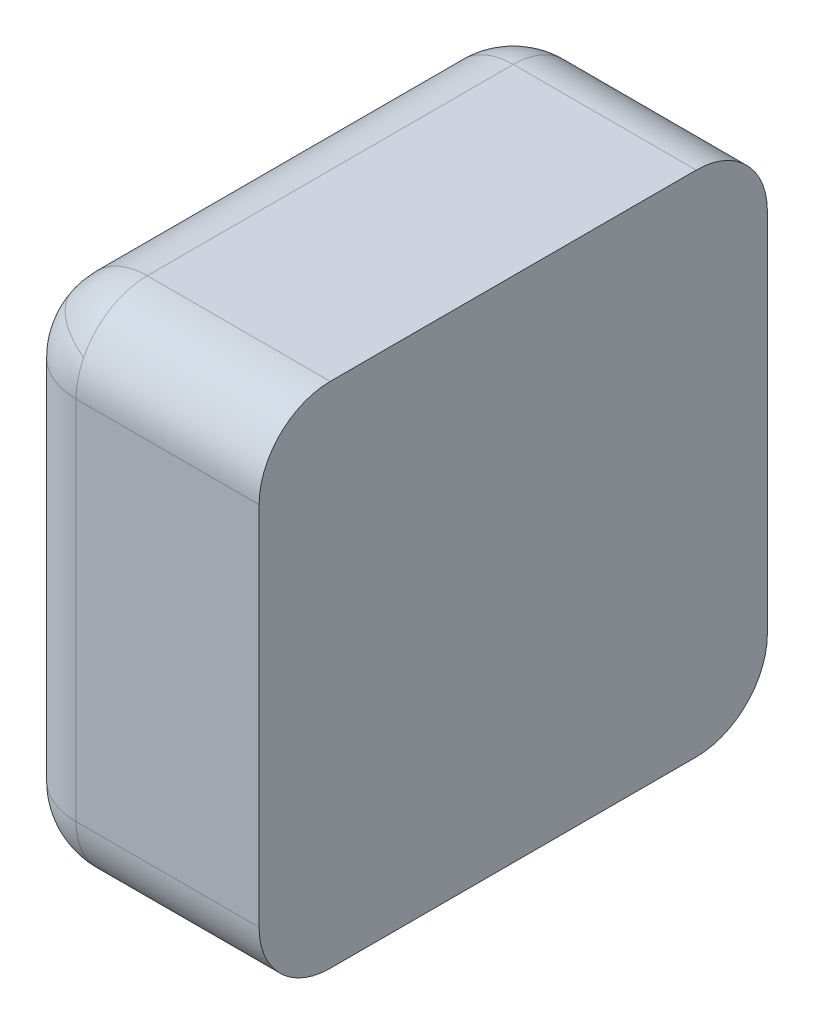
ISO-10303-21;
HEADER;
FILE_DESCRIPTION(('STEP AP214'),'2;1');
FILE_NAME('part.step','',(''),(''),'','','');
FILE_SCHEMA(('AUTOMOTIVE_DESIGN { 1 0 10303 214 1 1 1 1 }'));
ENDSEC;
DATA;
#1=APPLICATION_CONTEXT('core data for automotive mechanical design processes');
#2=APPLICATION_PROTOCOL_DEFINITION('international standard','automotive_design',2000,#1);
#3=PRODUCT_CONTEXT('',#1,'mechanical');
#4=PRODUCT('Part','Part','',(#3));
#5=PRODUCT_RELATED_PRODUCT_CATEGORY('part','',(#4));
#6=PRODUCT_DEFINITION_FORMATION('','',#4);
#7=PRODUCT_DEFINITION_CONTEXT('part definition',#1,'design');
#8=PRODUCT_DEFINITION('design','',#6,#7);
#9=PRODUCT_DEFINITION_SHAPE('','',#8);
#10=(LENGTH_UNIT() NAMED_UNIT(*) SI_UNIT(.MILLI.,.METRE.));
#11=(NAMED_UNIT(*) PLANE_ANGLE_UNIT() SI_UNIT($,.RADIAN.));
#12=(NAMED_UNIT(*) SI_UNIT($,.STERADIAN.) SOLID_ANGLE_UNIT());
#13=UNCERTAINTY_MEASURE_WITH_UNIT(LENGTH_MEASURE(1.E-05),#10,'distance_accuracy_value','');
#14=(GEOMETRIC_REPRESENTATION_CONTEXT(3) GLOBAL_UNCERTAINTY_ASSIGNED_CONTEXT((#13)) GLOBAL_UNIT_ASSIGNED_CONTEXT((#10,
#11,#12)) REPRESENTATION_CONTEXT('',''));
#15=CARTESIAN_POINT('',(0.,0.,0.));
#16=DIRECTION('',(0.,0.,1.));
#17=DIRECTION('',(1.,0.,0.));
#18=AXIS2_PLACEMENT_3D('',#15,#16,#17);
#19=CARTESIAN_POINT('',(-0.470414518843274,-0.220414518843274,0.0295854811567262));
#20=CARTESIAN_POINT('',(-0.470414518843274,-0.220414518843274,0.0295854811567261));
#21=CARTESIAN_POINT('',(-0.470414518843274,-0.220414518843274,0.0295854811567261));
#22=CARTESIAN_POINT('',(-0.470414518843274,-0.220414518843274,0.0295854811567261));
#23=CARTESIAN_POINT('',(-0.470414518843274,-0.203915602470369,0.0130865647838216));
#24=CARTESIAN_POINT('',(-0.432311903606339,-0.222966910088836,-0.00596474283464581));
#25=CARTESIAN_POINT('',(-0.432311903606339,-0.255964742834646,0.0270330899111634));
#26=CARTESIAN_POINT('',(-0.470414518843274,-0.236913435216178,0.0460843975296308));
#27=CARTESIAN_POINT('',(-0.464187485463227,-0.183058110300326,0.00468313937387294));
#28=CARTESIAN_POINT('',(-0.392297272943205,-0.219003216560337,-0.0312619668861382));
#29=CARTESIAN_POINT('',(-0.392297272943205,-0.281261966886138,0.0309967834396629));
#30=CARTESIAN_POINT('',(-0.464187485463227,-0.245316860626127,0.0669418896996739));
#31=CARTESIAN_POINT('',(-0.453143808025074,-0.16256615130185,0.00627853525170238));
#32=CARTESIAN_POINT('',(-0.359433723896123,-0.209421193366325,-0.0405765068127731));
#33=CARTESIAN_POINT('',(-0.359433723896123,-0.290576506812773,0.0405788066336749));
#34=CARTESIAN_POINT('',(-0.453143808025074,-0.243721464748298,0.0874338486981503));
#35=(BOUNDED_SURFACE() B_SPLINE_SURFACE(3,3,((#19,#20,#21,#22),(#23,#24,#25,#26),(#27,#28,#29,
#30),(#31,#32,#33,#34)),.UNSPECIFIED.,.F.,.F.,.F.) B_SPLINE_SURFACE_WITH_KNOTS((4,4),(4,4),(0.,
1.),(0.,1.),.UNSPECIFIED.) GEOMETRIC_REPRESENTATION_ITEM() RATIONAL_B_SPLINE_SURFACE(((1.,
0.333333333333333,0.333333333333333,1.),(0.924501806030638,0.308167268676879,0.308167268676879,
0.924501806030638),(0.924501806030638,0.308167268676879,0.308167268676879,0.924501806030638),
(1.,0.333333333333333,0.333333333333333,1.))) REPRESENTATION_ITEM('') SURFACE());
#36=CARTESIAN_POINT('',(-0.43,-0.18,0.07));
#37=DIRECTION('',(-0.816496580927726,0.408248290463863,0.408248290463863));
#38=DIRECTION('',(-0.577350269189626,-0.577350269189626,-0.577350269189626));
#39=AXIS2_PLACEMENT_3D('',#36,#37,#38);
#40=CIRCLE('',#39,0.07);
#41=CARTESIAN_POINT('',(-0.470414518843274,-0.220414518843274,0.0295854811567262));
#42=VERTEX_POINT('',#41);
#43=CARTESIAN_POINT('',(-0.461304951684997,-0.242609903369994,0.07));
#44=VERTEX_POINT('',#43);
#45=EDGE_CURVE('E11',#42,#44,#40,.T.);
#46=CARTESIAN_POINT('',(-0.43,-0.18,0.07));
#47=DIRECTION('',(0.816496580927726,-0.408248290463863,-0.408248290463863));
#48=DIRECTION('',(-0.577350269189626,-0.577350269189626,-0.577350269189626));
#49=AXIS2_PLACEMENT_3D('',#46,#47,#48);
#50=CIRCLE('',#49,0.07);
#51=CARTESIAN_POINT('',(-0.461304951684997,-0.18,0.00739009663000594));
#52=VERTEX_POINT('',#51);
#53=EDGE_CURVE('E26',#42,#52,#50,.T.);
#54=CARTESIAN_POINT('',(-0.43,-0.18,0.07));
#55=DIRECTION('',(0.,1.,0.));
#56=DIRECTION('',(1.,0.,0.));
#57=AXIS2_PLACEMENT_3D('',#54,#55,#56);
#58=CIRCLE('',#57,0.07);
#59=CARTESIAN_POINT('',(-0.43,-0.18,0.));
#60=VERTEX_POINT('',#59);
#61=EDGE_CURVE('E273',#60,#52,#58,.T.);
#62=CARTESIAN_POINT('',(-0.43,-0.18,0.07));
#63=DIRECTION('',(1.,0.,0.));
#64=DIRECTION('',(0.,0.,-1.));
#65=AXIS2_PLACEMENT_3D('',#62,#63,#64);
#66=CIRCLE('',#65,0.07);
#67=CARTESIAN_POINT('',(-0.43,-0.25,0.07));
#68=VERTEX_POINT('',#67);
#69=EDGE_CURVE('E270',#68,#60,#66,.T.);
#70=CARTESIAN_POINT('',(-0.43,-0.18,0.07));
#71=DIRECTION('',(0.,0.,-1.));
#72=DIRECTION('',(1.,0.,0.));
#73=AXIS2_PLACEMENT_3D('',#70,#71,#72);
#74=CIRCLE('',#73,0.07);
#75=EDGE_CURVE('E268',#68,#44,#74,.T.);
#76=ORIENTED_EDGE('',*,*,#45,.F.);
#77=ORIENTED_EDGE('',*,*,#53,.T.);
#78=ORIENTED_EDGE('',*,*,#61,.F.);
#79=ORIENTED_EDGE('',*,*,#69,.F.);
#80=ORIENTED_EDGE('',*,*,#75,.T.);
#81=EDGE_LOOP('',(#76,#77,#78,#79,#80));
#82=FACE_BOUND('',#81,.T.);
#83=ADVANCED_FACE('F17',(#82),#35,.T.);
#84=CARTESIAN_POINT('',(-0.470414518843274,-0.220414518843274,0.470414518843274));
#85=CARTESIAN_POINT('',(-0.470414518843274,-0.220414518843274,0.470414518843274));
#86=CARTESIAN_POINT('',(-0.470414518843274,-0.220414518843274,0.470414518843274));
#87=CARTESIAN_POINT('',(-0.470414518843274,-0.220414518843274,0.470414518843274));
#88=CARTESIAN_POINT('',(-0.453915602470369,-0.236913435216179,0.470414518843274));
#89=CARTESIAN_POINT('',(-0.434864294851902,-0.217862127597711,0.508517134080208));
#90=CARTESIAN_POINT('',(-0.467862127597711,-0.184864294851902,0.508517134080209));
#91=CARTESIAN_POINT('',(-0.486913435216178,-0.203915602470369,0.470414518843274));
#92=CARTESIAN_POINT('',(-0.433058110300326,-0.245316860626127,0.464187485463227));
#93=CARTESIAN_POINT('',(-0.397113004040315,-0.209371754366116,0.536077697983249));
#94=CARTESIAN_POINT('',(-0.459371754366116,-0.147113004040315,0.536077697983248));
#95=CARTESIAN_POINT('',(-0.495316860626127,-0.183058110300326,0.464187485463227));
#96=CARTESIAN_POINT('',(-0.41256615130185,-0.243721464748298,0.453143808025074));
#97=CARTESIAN_POINT('',(-0.365711109237374,-0.196866422683823,0.546853892154024));
#98=CARTESIAN_POINT('',(-0.446866422683823,-0.115711109237374,0.546853892154024));
#99=CARTESIAN_POINT('',(-0.493721464748298,-0.16256615130185,0.453143808025074));
#100=(BOUNDED_SURFACE() B_SPLINE_SURFACE(3,3,((#84,#85,#86,#87),(#88,#89,#90,#91),(#92,#93,#94,
#95),(#96,#97,#98,#99)),.UNSPECIFIED.,.F.,.F.,.F.) B_SPLINE_SURFACE_WITH_KNOTS((4,4),(4,4),(0.,
1.),(0.,1.),.UNSPECIFIED.) GEOMETRIC_REPRESENTATION_ITEM() RATIONAL_B_SPLINE_SURFACE(((1.,
0.333333333333333,0.333333333333333,1.),(0.924501806030637,0.308167268676879,0.308167268676879,
0.924501806030637),(0.924501806030637,0.308167268676879,0.308167268676879,0.924501806030637),
(1.,0.333333333333333,0.333333333333333,1.))) REPRESENTATION_ITEM('') SURFACE());
#101=CARTESIAN_POINT('',(-0.43,-0.18,0.43));
#102=DIRECTION('',(-0.408248290463863,-0.408248290463863,-0.816496580927726));
#103=DIRECTION('',(-0.577350269189626,-0.577350269189626,0.577350269189626));
#104=AXIS2_PLACEMENT_3D('',#101,#102,#103);
#105=CIRCLE('',#104,0.07);
#106=CARTESIAN_POINT('',(-0.470414518843274,-0.220414518843274,0.470414518843274));
#107=VERTEX_POINT('',#106);
#108=CARTESIAN_POINT('',(-0.492609903369994,-0.18,0.461304951684997));
#109=VERTEX_POINT('',#108);
#110=EDGE_CURVE('E266',#107,#109,#105,.T.);
#111=CARTESIAN_POINT('',(-0.43,-0.18,0.43));
#112=DIRECTION('',(0.408248290463863,0.408248290463863,0.816496580927726));
#113=DIRECTION('',(-0.577350269189626,-0.577350269189626,0.577350269189626));
#114=AXIS2_PLACEMENT_3D('',#111,#112,#113);
#115=CIRCLE('',#114,0.07);
#116=CARTESIAN_POINT('',(-0.43,-0.242609903369994,0.461304951684997));
#117=VERTEX_POINT('',#116);
#118=EDGE_CURVE('E264',#107,#117,#115,.T.);
#119=CARTESIAN_POINT('',(-0.43,-0.18,0.43));
#120=DIRECTION('',(1.,0.,0.));
#121=DIRECTION('',(0.,0.,-1.));
#122=AXIS2_PLACEMENT_3D('',#119,#120,#121);
#123=CIRCLE('',#122,0.07);
#124=CARTESIAN_POINT('',(-0.43,-0.18,0.5));
#125=VERTEX_POINT('',#124);
#126=EDGE_CURVE('E261',#125,#117,#123,.T.);
#127=CARTESIAN_POINT('',(-0.43,-0.18,0.43));
#128=DIRECTION('',(0.,-1.,0.));
#129=DIRECTION('',(1.,0.,0.));
#130=AXIS2_PLACEMENT_3D('',#127,#128,#129);
#131=CIRCLE('',#130,0.07);
#132=EDGE_CURVE('E258',#125,#109,#131,.T.);
#133=ORIENTED_EDGE('',*,*,#110,.F.);
#134=ORIENTED_EDGE('',*,*,#118,.T.);
#135=ORIENTED_EDGE('',*,*,#126,.F.);
#136=ORIENTED_EDGE('',*,*,#132,.T.);
#137=EDGE_LOOP('',(#133,#134,#135,#136));
#138=FACE_BOUND('',#137,.T.);
#139=ADVANCED_FACE('F333',(#138),#100,.T.);
#140=CARTESIAN_POINT('',(-0.470414518843274,0.220414518843274,0.470414518843274));
#141=CARTESIAN_POINT('',(-0.470414518843274,0.220414518843274,0.470414518843274));
#142=CARTESIAN_POINT('',(-0.470414518843274,0.220414518843274,0.470414518843274));
#143=CARTESIAN_POINT('',(-0.470414518843274,0.220414518843274,0.470414518843274));
#144=CARTESIAN_POINT('',(-0.453915602470369,0.220414518843274,0.486913435216178));
#145=CARTESIAN_POINT('',(-0.434864294851902,0.258517134080208,0.467862127597711));
#146=CARTESIAN_POINT('',(-0.467862127597712,0.258517134080208,0.434864294851902));
#147=CARTESIAN_POINT('',(-0.486913435216179,0.220414518843274,0.453915602470369));
#148=CARTESIAN_POINT('',(-0.433058110300326,0.214187485463227,0.495316860626127));
#149=CARTESIAN_POINT('',(-0.397113004040315,0.286077697983249,0.459371754366116));
#150=CARTESIAN_POINT('',(-0.459371754366116,0.286077697983249,0.397113004040315));
#151=CARTESIAN_POINT('',(-0.495316860626127,0.214187485463227,0.433058110300326));
#152=CARTESIAN_POINT('',(-0.41256615130185,0.203143808025074,0.493721464748298));
#153=CARTESIAN_POINT('',(-0.365711109237374,0.296853892154024,0.446866422683822));
#154=CARTESIAN_POINT('',(-0.446866422683822,0.296853892154024,0.365711109237375));
#155=CARTESIAN_POINT('',(-0.493721464748298,0.203143808025074,0.41256615130185));
#156=(BOUNDED_SURFACE() B_SPLINE_SURFACE(3,3,((#140,#141,#142,#143),(#144,#145,#146,#147),(#148,
#149,#150,#151),(#152,#153,#154,#155)),.UNSPECIFIED.,.F.,.F.,
.F.) B_SPLINE_SURFACE_WITH_KNOTS((4,4),(4,4),(0.,1.),(0.,1.),
.UNSPECIFIED.) GEOMETRIC_REPRESENTATION_ITEM() RATIONAL_B_SPLINE_SURFACE(((1.,0.333333333333333,
0.333333333333333,1.),(0.924501806030637,0.308167268676879,0.308167268676879,0.924501806030637),
(0.924501806030637,0.308167268676879,0.308167268676879,0.924501806030637),(1.,0.333333333333333,
0.333333333333333,1.))) REPRESENTATION_ITEM('') SURFACE());
#157=CARTESIAN_POINT('',(-0.43,0.18,0.43));
#158=DIRECTION('',(-0.408248290463863,-0.816496580927726,0.408248290463863));
#159=DIRECTION('',(-0.577350269189626,0.577350269189626,0.577350269189626));
#160=AXIS2_PLACEMENT_3D('',#157,#158,#159);
#161=CIRCLE('',#160,0.07);
#162=CARTESIAN_POINT('',(-0.470414518843274,0.220414518843274,0.470414518843274));
#163=VERTEX_POINT('',#162);
#164=CARTESIAN_POINT('',(-0.492609903369994,0.211304951684997,0.43));
#165=VERTEX_POINT('',#164);
#166=EDGE_CURVE('E157',#163,#165,#161,.T.);
#167=CARTESIAN_POINT('',(-0.43,0.18,0.43));
#168=DIRECTION('',(0.408248290463863,0.816496580927726,-0.408248290463863));
#169=DIRECTION('',(-0.577350269189626,0.577350269189626,0.577350269189626));
#170=AXIS2_PLACEMENT_3D('',#167,#168,#169);
#171=CIRCLE('',#170,0.07);
#172=CARTESIAN_POINT('',(-0.43,0.211304951684997,0.492609903369994));
#173=VERTEX_POINT('',#172);
#174=EDGE_CURVE('E255',#163,#173,#171,.T.);
#175=CARTESIAN_POINT('',(-0.43,0.18,0.43));
#176=DIRECTION('',(1.,0.,0.));
#177=DIRECTION('',(0.,-1.,0.));
#178=AXIS2_PLACEMENT_3D('',#175,#176,#177);
#179=CIRCLE('',#178,0.07);
#180=CARTESIAN_POINT('',(-0.43,0.25,0.43));
#181=VERTEX_POINT('',#180);
#182=EDGE_CURVE('E252',#181,#173,#179,.T.);
#183=CARTESIAN_POINT('',(-0.43,0.18,0.43));
#184=DIRECTION('',(0.,0.,1.));
#185=DIRECTION('',(1.,0.,0.));
#186=AXIS2_PLACEMENT_3D('',#183,#184,#185);
#187=CIRCLE('',#186,0.07);
#188=EDGE_CURVE('E250',#181,#165,#187,.T.);
#189=ORIENTED_EDGE('',*,*,#166,.F.);
#190=ORIENTED_EDGE('',*,*,#174,.T.);
#191=ORIENTED_EDGE('',*,*,#182,.F.);
#192=ORIENTED_EDGE('',*,*,#188,.T.);
#193=EDGE_LOOP('',(#189,#190,#191,#192));
#194=FACE_BOUND('',#193,.T.);
#195=ADVANCED_FACE('F304',(#194),#156,.T.);
#196=CARTESIAN_POINT('',(-0.470414518843274,0.220414518843274,0.0295854811567263));
#197=CARTESIAN_POINT('',(-0.470414518843274,0.220414518843274,0.0295854811567262));
#198=CARTESIAN_POINT('',(-0.470414518843274,0.220414518843274,0.029585481156726));
#199=CARTESIAN_POINT('',(-0.470414518843274,0.220414518843274,0.0295854811567261));
#200=CARTESIAN_POINT('',(-0.486913435216178,0.220414518843274,0.0460843975296309));
#201=CARTESIAN_POINT('',(-0.467862127597711,0.258517134080208,0.065135705148098));
#202=CARTESIAN_POINT('',(-0.434864294851902,0.258517134080208,0.0321378724022886));
#203=CARTESIAN_POINT('',(-0.453915602470369,0.220414518843274,0.0130865647838215));
#204=CARTESIAN_POINT('',(-0.495316860626127,0.214187485463227,0.0669418896996739));
#205=CARTESIAN_POINT('',(-0.459371754366116,0.286077697983248,0.102886995959685));
#206=CARTESIAN_POINT('',(-0.397113004040315,0.286077697983248,0.0406282456338836));
#207=CARTESIAN_POINT('',(-0.433058110300326,0.214187485463227,0.00468313937387291));
#208=CARTESIAN_POINT('',(-0.493721464748297,0.203143808025074,0.0874338486981504));
#209=CARTESIAN_POINT('',(-0.446866422683822,0.296853892154024,0.134288890762625));
#210=CARTESIAN_POINT('',(-0.365711109237374,0.296853892154024,0.0531335773161773));
#211=CARTESIAN_POINT('',(-0.41256615130185,0.203143808025074,0.0062785352517023));
#212=(BOUNDED_SURFACE() B_SPLINE_SURFACE(3,3,((#196,#197,#198,#199),(#200,#201,#202,#203),(#204,
#205,#206,#207),(#208,#209,#210,#211)),.UNSPECIFIED.,.F.,.F.,
.F.) B_SPLINE_SURFACE_WITH_KNOTS((4,4),(4,4),(0.,1.),(0.,1.),
.UNSPECIFIED.) GEOMETRIC_REPRESENTATION_ITEM() RATIONAL_B_SPLINE_SURFACE(((1.,0.333333333333334,
0.333333333333334,1.),(0.924501806030638,0.308167268676879,0.308167268676879,0.924501806030638),
(0.924501806030638,0.308167268676879,0.308167268676879,0.924501806030638),(1.,0.333333333333334,
0.333333333333334,1.))) REPRESENTATION_ITEM('') SURFACE());
#213=CARTESIAN_POINT('',(-0.43,0.18,0.07));
#214=DIRECTION('',(-0.408248290463863,-0.816496580927726,-0.408248290463863));
#215=DIRECTION('',(-0.577350269189626,0.577350269189626,-0.577350269189626));
#216=AXIS2_PLACEMENT_3D('',#213,#214,#215);
#217=CIRCLE('',#216,0.07);
#218=CARTESIAN_POINT('',(-0.470414518843274,0.220414518843274,0.0295854811567262));
#219=VERTEX_POINT('',#218);
#220=CARTESIAN_POINT('',(-0.43,0.211304951684997,0.0073900966300059));
#221=VERTEX_POINT('',#220);
#222=EDGE_CURVE('E248',#219,#221,#217,.T.);
#223=CARTESIAN_POINT('',(-0.43,0.18,0.0700000000000001));
#224=DIRECTION('',(0.408248290463863,0.816496580927726,0.408248290463863));
#225=DIRECTION('',(-0.577350269189626,0.577350269189626,-0.577350269189626));
#226=AXIS2_PLACEMENT_3D('',#223,#224,#225);
#227=CIRCLE('',#226,0.07);
#228=CARTESIAN_POINT('',(-0.492609903369994,0.211304951684997,0.07));
#229=VERTEX_POINT('',#228);
#230=EDGE_CURVE('E246',#219,#229,#227,.T.);
#231=CARTESIAN_POINT('',(-0.43,0.18,0.07));
#232=DIRECTION('',(0.,0.,1.));
#233=DIRECTION('',(1.,0.,0.));
#234=AXIS2_PLACEMENT_3D('',#231,#232,#233);
#235=CIRCLE('',#234,0.07);
#236=CARTESIAN_POINT('',(-0.43,0.25,0.07));
#237=VERTEX_POINT('',#236);
#238=EDGE_CURVE('E244',#237,#229,#235,.T.);
#239=CARTESIAN_POINT('',(-0.43,0.18,0.07));
#240=DIRECTION('',(1.,0.,0.));
#241=DIRECTION('',(0.,-1.,0.));
#242=AXIS2_PLACEMENT_3D('',#239,#240,#241);
#243=CIRCLE('',#242,0.07);
#244=EDGE_CURVE('E241',#221,#237,#243,.T.);
#245=ORIENTED_EDGE('',*,*,#222,.F.);
#246=ORIENTED_EDGE('',*,*,#230,.T.);
#247=ORIENTED_EDGE('',*,*,#238,.F.);
#248=ORIENTED_EDGE('',*,*,#244,.F.);
#249=EDGE_LOOP('',(#245,#246,#247,#248));
#250=FACE_BOUND('',#249,.T.);
#251=ADVANCED_FACE('F317',(#250),#212,.T.);
#252=CARTESIAN_POINT('',(-0.25,-0.25,0.));
#253=DIRECTION('',(1.,0.,0.));
#254=DIRECTION('',(0.,0.,-1.));
#255=AXIS2_PLACEMENT_3D('',#252,#253,#254);
#256=PLANE('',#255);
#257=CARTESIAN_POINT('',(-0.25,-0.18,0.07));
#258=DIRECTION('',(1.,0.,0.));
#259=DIRECTION('',(0.,0.,-1.));
#260=AXIS2_PLACEMENT_3D('',#257,#258,#259);
#261=CIRCLE('',#260,0.07);
#262=CARTESIAN_POINT('',(-0.25,-0.25,0.07));
#263=VERTEX_POINT('',#262);
#264=CARTESIAN_POINT('',(-0.25,-0.18,0.));
#265=VERTEX_POINT('',#264);
#266=EDGE_CURVE('E239',#263,#265,#261,.T.);
#267=ORIENTED_EDGE('',*,*,#266,.T.);
#268=DIRECTION('',(0.,1.,0.));
#269=VECTOR('',#268,1.);
#270=CARTESIAN_POINT('',(-0.25,-0.25,0.));
#271=LINE('',#270,#269);
#272=CARTESIAN_POINT('',(-0.25,0.18,0.));
#273=VERTEX_POINT('',#272);
#274=EDGE_CURVE('E237',#265,#273,#271,.T.);
#275=ORIENTED_EDGE('',*,*,#274,.T.);
#276=CARTESIAN_POINT('',(-0.25,0.18,0.07));
#277=DIRECTION('',(1.,0.,0.));
#278=DIRECTION('',(0.,-1.,0.));
#279=AXIS2_PLACEMENT_3D('',#276,#277,#278);
#280=CIRCLE('',#279,0.07);
#281=CARTESIAN_POINT('',(-0.25,0.25,0.07));
#282=VERTEX_POINT('',#281);
#283=EDGE_CURVE('E235',#273,#282,#280,.T.);
#284=ORIENTED_EDGE('',*,*,#283,.T.);
#285=DIRECTION('',(0.,0.,1.));
#286=VECTOR('',#285,1.);
#287=CARTESIAN_POINT('',(-0.25,0.25,0.));
#288=LINE('',#287,#286);
#289=CARTESIAN_POINT('',(-0.25,0.25,0.43));
#290=VERTEX_POINT('',#289);
#291=EDGE_CURVE('E233',#282,#290,#288,.T.);
#292=ORIENTED_EDGE('',*,*,#291,.T.);
#293=CARTESIAN_POINT('',(-0.25,0.18,0.43));
#294=DIRECTION('',(1.,0.,0.));
#295=DIRECTION('',(0.,-1.,0.));
#296=AXIS2_PLACEMENT_3D('',#293,#294,#295);
#297=CIRCLE('',#296,0.07);
#298=CARTESIAN_POINT('',(-0.25,0.18,0.5));
#299=VERTEX_POINT('',#298);
#300=EDGE_CURVE('E231',#290,#299,#297,.T.);
#301=ORIENTED_EDGE('',*,*,#300,.T.);
#302=DIRECTION('',(0.,-1.,0.));
#303=VECTOR('',#302,1.);
#304=CARTESIAN_POINT('',(-0.25,-0.25,0.5));
#305=LINE('',#304,#303);
#306=CARTESIAN_POINT('',(-0.25,-0.18,0.5));
#307=VERTEX_POINT('',#306);
#308=EDGE_CURVE('E229',#299,#307,#305,.T.);
#309=ORIENTED_EDGE('',*,*,#308,.T.);
#310=CARTESIAN_POINT('',(-0.25,-0.18,0.43));
#311=DIRECTION('',(1.,0.,0.));
#312=DIRECTION('',(0.,0.,-1.));
#313=AXIS2_PLACEMENT_3D('',#310,#311,#312);
#314=CIRCLE('',#313,0.07);
#315=CARTESIAN_POINT('',(-0.25,-0.25,0.43));
#316=VERTEX_POINT('',#315);
#317=EDGE_CURVE('E227',#307,#316,#314,.T.);
#318=ORIENTED_EDGE('',*,*,#317,.T.);
#319=DIRECTION('',(0.,0.,-1.));
#320=VECTOR('',#319,1.);
#321=CARTESIAN_POINT('',(-0.25,-0.25,0.));
#322=LINE('',#321,#320);
#323=EDGE_CURVE('E224',#316,#263,#322,.T.);
#324=ORIENTED_EDGE('',*,*,#323,.T.);
#325=EDGE_LOOP('',(#267,#275,#284,#292,#301,#309,#318,#324));
#326=FACE_BOUND('',#325,.T.);
#327=ADVANCED_FACE('F360',(#326),#256,.T.);
#328=CARTESIAN_POINT('',(-0.375,0.,0.));
#329=DIRECTION('',(0.,0.,1.));
#330=DIRECTION('',(1.,0.,0.));
#331=AXIS2_PLACEMENT_3D('',#328,#329,#330);
#332=PLANE('',#331);
#333=ORIENTED_EDGE('',*,*,#274,.F.);
#334=DIRECTION('',(1.,0.,0.));
#335=VECTOR('',#334,1.);
#336=CARTESIAN_POINT('',(-0.375,-0.18,0.));
#337=LINE('',#336,#335);
#338=EDGE_CURVE('E221',#60,#265,#337,.T.);
#339=ORIENTED_EDGE('',*,*,#338,.F.);
#340=DIRECTION('',(0.,-1.,0.));
#341=VECTOR('',#340,1.);
#342=CARTESIAN_POINT('',(-0.43,0.,0.));
#343=LINE('',#342,#341);
#344=CARTESIAN_POINT('',(-0.43,0.18,0.));
#345=VERTEX_POINT('',#344);
#346=EDGE_CURVE('E218',#345,#60,#343,.T.);
#347=ORIENTED_EDGE('',*,*,#346,.F.);
#348=DIRECTION('',(-1.,0.,0.));
#349=VECTOR('',#348,1.);
#350=CARTESIAN_POINT('',(-0.375,0.18,0.));
#351=LINE('',#350,#349);
#352=EDGE_CURVE('E215',#273,#345,#351,.T.);
#353=ORIENTED_EDGE('',*,*,#352,.F.);
#354=EDGE_LOOP('',(#333,#339,#347,#353));
#355=FACE_BOUND('',#354,.T.);
#356=ADVANCED_FACE('F368',(#355),#332,.F.);
#357=CARTESIAN_POINT('',(-0.4375,-0.18,0.07));
#358=DIRECTION('',(1.,0.,0.));
#359=DIRECTION('',(0.,0.,-1.));
#360=AXIS2_PLACEMENT_3D('',#357,#358,#359);
#361=CYLINDRICAL_SURFACE('',#360,0.07);
#362=ORIENTED_EDGE('',*,*,#69,.T.);
#363=ORIENTED_EDGE('',*,*,#338,.T.);
#364=ORIENTED_EDGE('',*,*,#266,.F.);
#365=DIRECTION('',(-1.,0.,0.));
#366=VECTOR('',#365,1.);
#367=CARTESIAN_POINT('',(-0.4375,-0.25,0.07));
#368=LINE('',#367,#366);
#369=EDGE_CURVE('E212',#263,#68,#368,.T.);
#370=ORIENTED_EDGE('',*,*,#369,.T.);
#371=EDGE_LOOP('',(#362,#363,#364,#370));
#372=FACE_BOUND('',#371,.T.);
#373=ADVANCED_FACE('F372',(#372),#361,.T.);
#374=CARTESIAN_POINT('',(-0.5,-0.25,0.));
#375=DIRECTION('',(0.,-1.,0.));
#376=DIRECTION('',(0.,0.,-1.));
#377=AXIS2_PLACEMENT_3D('',#374,#375,#376);
#378=PLANE('',#377);
#379=DIRECTION('',(-1.,0.,0.));
#380=VECTOR('',#379,1.);
#381=CARTESIAN_POINT('',(-0.5,-0.25,0.43));
#382=LINE('',#381,#380);
#383=CARTESIAN_POINT('',(-0.43,-0.25,0.43));
#384=VERTEX_POINT('',#383);
#385=EDGE_CURVE('E210',#316,#384,#382,.T.);
#386=ORIENTED_EDGE('',*,*,#385,.T.);
#387=DIRECTION('',(0.,0.,-1.));
#388=VECTOR('',#387,1.);
#389=CARTESIAN_POINT('',(-0.43,-0.25,0.));
#390=LINE('',#389,#388);
#391=EDGE_CURVE('E207',#384,#68,#390,.T.);
#392=ORIENTED_EDGE('',*,*,#391,.T.);
#393=ORIENTED_EDGE('',*,*,#369,.F.);
#394=ORIENTED_EDGE('',*,*,#323,.F.);
#395=EDGE_LOOP('',(#386,#392,#393,#394));
#396=FACE_BOUND('',#395,.T.);
#397=ADVANCED_FACE('F376',(#396),#378,.T.);
#398=CARTESIAN_POINT('',(-0.4375,-0.18,0.43));
#399=DIRECTION('',(1.,0.,0.));
#400=DIRECTION('',(0.,0.,-1.));
#401=AXIS2_PLACEMENT_3D('',#398,#399,#400);
#402=CYLINDRICAL_SURFACE('',#401,0.07);
#403=ORIENTED_EDGE('',*,*,#126,.T.);
#404=CARTESIAN_POINT('',(-0.43,-0.18,0.43));
#405=DIRECTION('',(1.,0.,0.));
#406=DIRECTION('',(0.,0.,-1.));
#407=AXIS2_PLACEMENT_3D('',#404,#405,#406);
#408=CIRCLE('',#407,0.07);
#409=EDGE_CURVE('E204',#117,#384,#408,.T.);
#410=ORIENTED_EDGE('',*,*,#409,.T.);
#411=ORIENTED_EDGE('',*,*,#385,.F.);
#412=ORIENTED_EDGE('',*,*,#317,.F.);
#413=DIRECTION('',(-1.,0.,0.));
#414=VECTOR('',#413,1.);
#415=CARTESIAN_POINT('',(-0.4375,-0.18,0.5));
#416=LINE('',#415,#414);
#417=EDGE_CURVE('E201',#307,#125,#416,.T.);
#418=ORIENTED_EDGE('',*,*,#417,.T.);
#419=EDGE_LOOP('',(#403,#410,#411,#412,#418));
#420=FACE_BOUND('',#419,.T.);
#421=ADVANCED_FACE('F293',(#420),#402,.T.);
#422=CARTESIAN_POINT('',(-0.375,0.,0.5));
#423=DIRECTION('',(0.,0.,1.));
#424=DIRECTION('',(1.,0.,0.));
#425=AXIS2_PLACEMENT_3D('',#422,#423,#424);
#426=PLANE('',#425);
#427=ORIENTED_EDGE('',*,*,#417,.F.);
#428=ORIENTED_EDGE('',*,*,#308,.F.);
#429=DIRECTION('',(-1.,0.,0.));
#430=VECTOR('',#429,1.);
#431=CARTESIAN_POINT('',(-0.375,0.18,0.5));
#432=LINE('',#431,#430);
#433=CARTESIAN_POINT('',(-0.43,0.18,0.5));
#434=VERTEX_POINT('',#433);
#435=EDGE_CURVE('E199',#299,#434,#432,.T.);
#436=ORIENTED_EDGE('',*,*,#435,.T.);
#437=DIRECTION('',(0.,-1.,0.));
#438=VECTOR('',#437,1.);
#439=CARTESIAN_POINT('',(-0.43,0.,0.5));
#440=LINE('',#439,#438);
#441=EDGE_CURVE('E135',#434,#125,#440,.T.);
#442=ORIENTED_EDGE('',*,*,#441,.T.);
#443=EDGE_LOOP('',(#427,#428,#436,#442));
#444=FACE_BOUND('',#443,.T.);
#445=ADVANCED_FACE('F297',(#444),#426,.T.);
#446=CARTESIAN_POINT('',(-0.3125,0.18,0.43));
#447=DIRECTION('',(-1.,0.,0.));
#448=DIRECTION('',(0.,-1.,0.));
#449=AXIS2_PLACEMENT_3D('',#446,#447,#448);
#450=CYLINDRICAL_SURFACE('',#449,0.07);
#451=ORIENTED_EDGE('',*,*,#182,.T.);
#452=CARTESIAN_POINT('',(-0.43,0.18,0.43));
#453=DIRECTION('',(1.,0.,0.));
#454=DIRECTION('',(0.,-1.,0.));
#455=AXIS2_PLACEMENT_3D('',#452,#453,#454);
#456=CIRCLE('',#455,0.07);
#457=EDGE_CURVE('E196',#173,#434,#456,.T.);
#458=ORIENTED_EDGE('',*,*,#457,.T.);
#459=ORIENTED_EDGE('',*,*,#435,.F.);
#460=ORIENTED_EDGE('',*,*,#300,.F.);
#461=DIRECTION('',(-1.,0.,0.));
#462=VECTOR('',#461,1.);
#463=CARTESIAN_POINT('',(-0.3125,0.25,0.43));
#464=LINE('',#463,#462);
#465=EDGE_CURVE('E193',#290,#181,#464,.T.);
#466=ORIENTED_EDGE('',*,*,#465,.T.);
#467=EDGE_LOOP('',(#451,#458,#459,#460,#466));
#468=FACE_BOUND('',#467,.T.);
#469=ADVANCED_FACE('F301',(#468),#450,.T.);
#470=CARTESIAN_POINT('',(-0.25,0.25,0.));
#471=DIRECTION('',(0.,1.,0.));
#472=DIRECTION('',(-1.,0.,0.));
#473=AXIS2_PLACEMENT_3D('',#470,#471,#472);
#474=PLANE('',#473);
#475=ORIENTED_EDGE('',*,*,#465,.F.);
#476=ORIENTED_EDGE('',*,*,#291,.F.);
#477=DIRECTION('',(-1.,0.,0.));
#478=VECTOR('',#477,1.);
#479=CARTESIAN_POINT('',(-0.25,0.25,0.07));
#480=LINE('',#479,#478);
#481=EDGE_CURVE('E190',#282,#237,#480,.T.);
#482=ORIENTED_EDGE('',*,*,#481,.T.);
#483=DIRECTION('',(0.,0.,1.));
#484=VECTOR('',#483,1.);
#485=CARTESIAN_POINT('',(-0.43,0.25,0.));
#486=LINE('',#485,#484);
#487=EDGE_CURVE('E187',#237,#181,#486,.T.);
#488=ORIENTED_EDGE('',*,*,#487,.T.);
#489=EDGE_LOOP('',(#475,#476,#482,#488));
#490=FACE_BOUND('',#489,.T.);
#491=ADVANCED_FACE('F308',(#490),#474,.T.);
#492=CARTESIAN_POINT('',(-0.3125,0.18,0.07));
#493=DIRECTION('',(-1.,0.,0.));
#494=DIRECTION('',(0.,-1.,0.));
#495=AXIS2_PLACEMENT_3D('',#492,#493,#494);
#496=CYLINDRICAL_SURFACE('',#495,0.07);
#497=CARTESIAN_POINT('',(-0.43,0.18,0.07));
#498=DIRECTION('',(1.,0.,0.));
#499=DIRECTION('',(0.,-1.,0.));
#500=AXIS2_PLACEMENT_3D('',#497,#498,#499);
#501=CIRCLE('',#500,0.07);
#502=EDGE_CURVE('E184',#345,#221,#501,.T.);
#503=ORIENTED_EDGE('',*,*,#502,.T.);
#504=ORIENTED_EDGE('',*,*,#244,.T.);
#505=ORIENTED_EDGE('',*,*,#481,.F.);
#506=ORIENTED_EDGE('',*,*,#283,.F.);
#507=ORIENTED_EDGE('',*,*,#352,.T.);
#508=EDGE_LOOP('',(#503,#504,#505,#506,#507));
#509=FACE_BOUND('',#508,.T.);
#510=ADVANCED_FACE('F312',(#509),#496,.T.);
#511=CARTESIAN_POINT('',(-0.43,0.125,0.07));
#512=DIRECTION('',(0.,-1.,0.));
#513=DIRECTION('',(1.,0.,0.));
#514=AXIS2_PLACEMENT_3D('',#511,#512,#513);
#515=CYLINDRICAL_SURFACE('',#514,0.07);
#516=CARTESIAN_POINT('',(-0.43,0.18,0.07));
#517=DIRECTION('',(0.,-1.,0.));
#518=DIRECTION('',(1.,0.,0.));
#519=AXIS2_PLACEMENT_3D('',#516,#517,#518);
#520=CIRCLE('',#519,0.07);
#521=CARTESIAN_POINT('',(-0.5,0.18,0.07));
#522=VERTEX_POINT('',#521);
#523=EDGE_CURVE('E181',#522,#345,#520,.T.);
#524=ORIENTED_EDGE('',*,*,#523,.T.);
#525=ORIENTED_EDGE('',*,*,#346,.T.);
#526=ORIENTED_EDGE('',*,*,#61,.T.);
#527=CARTESIAN_POINT('',(-0.43,-0.18,0.07));
#528=DIRECTION('',(0.,1.,0.));
#529=DIRECTION('',(1.,0.,0.));
#530=AXIS2_PLACEMENT_3D('',#527,#528,#529);
#531=CIRCLE('',#530,0.07);
#532=CARTESIAN_POINT('',(-0.5,-0.18,0.07));
#533=VERTEX_POINT('',#532);
#534=EDGE_CURVE('E179',#52,#533,#531,.T.);
#535=ORIENTED_EDGE('',*,*,#534,.T.);
#536=DIRECTION('',(0.,1.,0.));
#537=VECTOR('',#536,1.);
#538=CARTESIAN_POINT('',(-0.5,0.125,0.07));
#539=LINE('',#538,#537);
#540=EDGE_CURVE('E176',#533,#522,#539,.T.);
#541=ORIENTED_EDGE('',*,*,#540,.T.);
#542=EDGE_LOOP('',(#524,#525,#526,#535,#541));
#543=FACE_BOUND('',#542,.T.);
#544=ADVANCED_FACE('F277',(#543),#515,.T.);
#545=CARTESIAN_POINT('',(-0.470414518843274,-0.220414518843274,0.0295854811567262));
#546=CARTESIAN_POINT('',(-0.470414518843274,-0.220414518843274,0.0295854811567262));
#547=CARTESIAN_POINT('',(-0.470414518843274,-0.220414518843274,0.0295854811567263));
#548=CARTESIAN_POINT('',(-0.470414518843274,-0.220414518843274,0.0295854811567262));
#549=CARTESIAN_POINT('',(-0.470414518843274,-0.236913435216178,0.0460843975296308));
#550=CARTESIAN_POINT('',(-0.508517134080208,-0.217862127597711,0.0651357051480981));
#551=CARTESIAN_POINT('',(-0.508517134080208,-0.184864294851902,0.0321378724022889));
#552=CARTESIAN_POINT('',(-0.470414518843274,-0.203915602470369,0.0130865647838216));
#553=CARTESIAN_POINT('',(-0.464187485463227,-0.245316860626127,0.0669418896996738));
#554=CARTESIAN_POINT('',(-0.536077697983248,-0.209371754366116,0.102886995959685));
#555=CARTESIAN_POINT('',(-0.536077697983248,-0.147113004040315,0.0406282456338841));
#556=CARTESIAN_POINT('',(-0.464187485463227,-0.183058110300326,0.00468313937387302));
#557=CARTESIAN_POINT('',(-0.453143808025073,-0.243721464748298,0.0874338486981502));
#558=CARTESIAN_POINT('',(-0.546853892154024,-0.196866422683823,0.134288890762626));
#559=CARTESIAN_POINT('',(-0.546853892154024,-0.115711109237375,0.0531335773161777));
#560=CARTESIAN_POINT('',(-0.453143808025074,-0.16256615130185,0.00627853525170241));
#561=(BOUNDED_SURFACE() B_SPLINE_SURFACE(3,3,((#545,#546,#547,#548),(#549,#550,#551,#552),(#553,
#554,#555,#556),(#557,#558,#559,#560)),.UNSPECIFIED.,.F.,.F.,
.F.) B_SPLINE_SURFACE_WITH_KNOTS((4,4),(4,4),(0.,1.),(0.,1.),
.UNSPECIFIED.) GEOMETRIC_REPRESENTATION_ITEM() RATIONAL_B_SPLINE_SURFACE(((1.,0.333333333333333,
0.333333333333333,1.),(0.924501806030638,0.308167268676879,0.308167268676879,0.924501806030638),
(0.924501806030638,0.308167268676879,0.308167268676879,0.924501806030638),(1.,0.333333333333333,
0.333333333333333,1.))) REPRESENTATION_ITEM('') SURFACE());
#562=CARTESIAN_POINT('',(-0.43,-0.18,0.07));
#563=DIRECTION('',(0.,0.,-1.));
#564=DIRECTION('',(1.,0.,0.));
#565=AXIS2_PLACEMENT_3D('',#562,#563,#564);
#566=CIRCLE('',#565,0.07);
#567=EDGE_CURVE('E174',#44,#533,#566,.T.);
#568=ORIENTED_EDGE('',*,*,#53,.F.);
#569=ORIENTED_EDGE('',*,*,#45,.T.);
#570=ORIENTED_EDGE('',*,*,#567,.T.);
#571=ORIENTED_EDGE('',*,*,#534,.F.);
#572=EDGE_LOOP('',(#568,#569,#570,#571));
#573=FACE_BOUND('',#572,.T.);
#574=ADVANCED_FACE('F278',(#573),#561,.T.);
#575=CARTESIAN_POINT('',(-0.43,-0.18,0.));
#576=DIRECTION('',(0.,0.,1.));
#577=DIRECTION('',(1.,0.,0.));
#578=AXIS2_PLACEMENT_3D('',#575,#576,#577);
#579=CYLINDRICAL_SURFACE('',#578,0.07);
#580=ORIENTED_EDGE('',*,*,#75,.F.);
#581=ORIENTED_EDGE('',*,*,#391,.F.);
#582=CARTESIAN_POINT('',(-0.43,-0.18,0.43));
#583=DIRECTION('',(0.,0.,-1.));
#584=DIRECTION('',(1.,0.,0.));
#585=AXIS2_PLACEMENT_3D('',#582,#583,#584);
#586=CIRCLE('',#585,0.07);
#587=CARTESIAN_POINT('',(-0.5,-0.18,0.43));
#588=VERTEX_POINT('',#587);
#589=EDGE_CURVE('E172',#384,#588,#586,.T.);
#590=ORIENTED_EDGE('',*,*,#589,.T.);
#591=DIRECTION('',(0.,0.,-1.));
#592=VECTOR('',#591,1.);
#593=CARTESIAN_POINT('',(-0.5,-0.18,0.));
#594=LINE('',#593,#592);
#595=EDGE_CURVE('E150',#588,#533,#594,.T.);
#596=ORIENTED_EDGE('',*,*,#595,.T.);
#597=ORIENTED_EDGE('',*,*,#567,.F.);
#598=EDGE_LOOP('',(#580,#581,#590,#596,#597));
#599=FACE_BOUND('',#598,.T.);
#600=ADVANCED_FACE('F282',(#599),#579,.T.);
#601=CARTESIAN_POINT('',(-0.470414518843274,-0.220414518843274,0.470414518843274));
#602=CARTESIAN_POINT('',(-0.470414518843274,-0.220414518843274,0.470414518843274));
#603=CARTESIAN_POINT('',(-0.470414518843274,-0.220414518843274,0.470414518843274));
#604=CARTESIAN_POINT('',(-0.470414518843274,-0.220414518843274,0.470414518843274));
#605=CARTESIAN_POINT('',(-0.486913435216178,-0.203915602470369,0.470414518843274));
#606=CARTESIAN_POINT('',(-0.505964742834645,-0.222966910088836,0.43231190360634));
#607=CARTESIAN_POINT('',(-0.472966910088837,-0.255964742834646,0.43231190360634));
#608=CARTESIAN_POINT('',(-0.453915602470369,-0.236913435216179,0.470414518843274));
#609=CARTESIAN_POINT('',(-0.495316860626127,-0.183058110300326,0.464187485463227));
#610=CARTESIAN_POINT('',(-0.531261966886138,-0.219003216560337,0.392297272943205));
#611=CARTESIAN_POINT('',(-0.469003216560337,-0.281261966886138,0.392297272943205));
#612=CARTESIAN_POINT('',(-0.433058110300326,-0.245316860626127,0.464187485463227));
#613=CARTESIAN_POINT('',(-0.493721464748297,-0.16256615130185,0.453143808025074));
#614=CARTESIAN_POINT('',(-0.540576506812773,-0.209421193366325,0.359433723896123));
#615=CARTESIAN_POINT('',(-0.459421193366325,-0.290576506812773,0.359433723896124));
#616=CARTESIAN_POINT('',(-0.41256615130185,-0.243721464748298,0.453143808025074));
#617=(BOUNDED_SURFACE() B_SPLINE_SURFACE(3,3,((#601,#602,#603,#604),(#605,#606,#607,#608),(#609,
#610,#611,#612),(#613,#614,#615,#616)),.UNSPECIFIED.,.F.,.F.,
.F.) B_SPLINE_SURFACE_WITH_KNOTS((4,4),(4,4),(0.,1.),(0.,1.),
.UNSPECIFIED.) GEOMETRIC_REPRESENTATION_ITEM() RATIONAL_B_SPLINE_SURFACE(((1.,0.333333333333333,
0.333333333333333,1.),(0.924501806030638,0.308167268676879,0.308167268676879,0.924501806030638),
(0.924501806030638,0.308167268676879,0.308167268676879,0.924501806030638),(1.,0.333333333333333,
0.333333333333333,1.))) REPRESENTATION_ITEM('') SURFACE());
#618=CARTESIAN_POINT('',(-0.43,-0.18,0.43));
#619=DIRECTION('',(0.,-1.,0.));
#620=DIRECTION('',(1.,0.,0.));
#621=AXIS2_PLACEMENT_3D('',#618,#619,#620);
#622=CIRCLE('',#621,0.07);
#623=EDGE_CURVE('E140',#109,#588,#622,.T.);
#624=ORIENTED_EDGE('',*,*,#118,.F.);
#625=ORIENTED_EDGE('',*,*,#110,.T.);
#626=ORIENTED_EDGE('',*,*,#623,.T.);
#627=ORIENTED_EDGE('',*,*,#589,.F.);
#628=ORIENTED_EDGE('',*,*,#409,.F.);
#629=EDGE_LOOP('',(#624,#625,#626,#627,#628));
#630=FACE_BOUND('',#629,.T.);
#631=ADVANCED_FACE('F288',(#630),#617,.T.);
#632=CARTESIAN_POINT('',(-0.43,0.125,0.43));
#633=DIRECTION('',(0.,-1.,0.));
#634=DIRECTION('',(1.,0.,0.));
#635=AXIS2_PLACEMENT_3D('',#632,#633,#634);
#636=CYLINDRICAL_SURFACE('',#635,0.07);
#637=CARTESIAN_POINT('',(-0.43,0.18,0.43));
#638=DIRECTION('',(0.,-1.,0.));
#639=DIRECTION('',(1.,0.,0.));
#640=AXIS2_PLACEMENT_3D('',#637,#638,#639);
#641=CIRCLE('',#640,0.07);
#642=CARTESIAN_POINT('',(-0.5,0.18,0.43));
#643=VERTEX_POINT('',#642);
#644=EDGE_CURVE('E128',#434,#643,#641,.T.);
#645=ORIENTED_EDGE('',*,*,#644,.T.);
#646=DIRECTION('',(0.,-1.,0.));
#647=VECTOR('',#646,1.);
#648=CARTESIAN_POINT('',(-0.5,0.125,0.43));
#649=LINE('',#648,#647);
#650=EDGE_CURVE('E132',#643,#588,#649,.T.);
#651=ORIENTED_EDGE('',*,*,#650,.T.);
#652=ORIENTED_EDGE('',*,*,#623,.F.);
#653=ORIENTED_EDGE('',*,*,#132,.F.);
#654=ORIENTED_EDGE('',*,*,#441,.F.);
#655=EDGE_LOOP('',(#645,#651,#652,#653,#654));
#656=FACE_BOUND('',#655,.T.);
#657=ADVANCED_FACE('F130',(#656),#636,.T.);
#658=CARTESIAN_POINT('',(-0.470414518843274,0.220414518843274,0.470414518843274));
#659=CARTESIAN_POINT('',(-0.470414518843274,0.220414518843274,0.470414518843274));
#660=CARTESIAN_POINT('',(-0.470414518843274,0.220414518843274,0.470414518843274));
#661=CARTESIAN_POINT('',(-0.470414518843274,0.220414518843274,0.470414518843274));
#662=CARTESIAN_POINT('',(-0.486913435216178,0.220414518843274,0.453915602470369));
#663=CARTESIAN_POINT('',(-0.505964742834646,0.182311903606339,0.472966910088836));
#664=CARTESIAN_POINT('',(-0.472966910088837,0.182311903606339,0.505964742834646));
#665=CARTESIAN_POINT('',(-0.453915602470369,0.220414518843274,0.486913435216179));
#666=CARTESIAN_POINT('',(-0.495316860626127,0.214187485463227,0.433058110300326));
#667=CARTESIAN_POINT('',(-0.531261966886138,0.142297272943205,0.469003216560337));
#668=CARTESIAN_POINT('',(-0.469003216560337,0.142297272943205,0.531261966886138));
#669=CARTESIAN_POINT('',(-0.433058110300326,0.214187485463227,0.495316860626127));
#670=CARTESIAN_POINT('',(-0.493721464748297,0.203143808025074,0.41256615130185));
#671=CARTESIAN_POINT('',(-0.540576506812773,0.109433723896123,0.459421193366325));
#672=CARTESIAN_POINT('',(-0.459421193366325,0.109433723896123,0.540576506812773));
#673=CARTESIAN_POINT('',(-0.41256615130185,0.203143808025074,0.493721464748298));
#674=(BOUNDED_SURFACE() B_SPLINE_SURFACE(3,3,((#658,#659,#660,#661),(#662,#663,#664,#665),(#666,
#667,#668,#669),(#670,#671,#672,#673)),.UNSPECIFIED.,.F.,.F.,
.F.) B_SPLINE_SURFACE_WITH_KNOTS((4,4),(4,4),(0.,1.),(0.,1.),
.UNSPECIFIED.) GEOMETRIC_REPRESENTATION_ITEM() RATIONAL_B_SPLINE_SURFACE(((1.,0.333333333333333,
0.333333333333333,1.),(0.924501806030638,0.308167268676879,0.308167268676879,0.924501806030638),
(0.924501806030638,0.308167268676879,0.308167268676879,0.924501806030638),(1.,0.333333333333333,
0.333333333333333,1.))) REPRESENTATION_ITEM('') SURFACE());
#675=CARTESIAN_POINT('',(-0.43,0.18,0.43));
#676=DIRECTION('',(0.,0.,1.));
#677=DIRECTION('',(1.,0.,0.));
#678=AXIS2_PLACEMENT_3D('',#675,#676,#677);
#679=CIRCLE('',#678,0.07);
#680=EDGE_CURVE('E152',#165,#643,#679,.T.);
#681=ORIENTED_EDGE('',*,*,#174,.F.);
#682=ORIENTED_EDGE('',*,*,#166,.T.);
#683=ORIENTED_EDGE('',*,*,#680,.T.);
#684=ORIENTED_EDGE('',*,*,#644,.F.);
#685=ORIENTED_EDGE('',*,*,#457,.F.);
#686=EDGE_LOOP('',(#681,#682,#683,#684,#685));
#687=FACE_BOUND('',#686,.T.);
#688=ADVANCED_FACE('F156',(#687),#674,.T.);
#689=CARTESIAN_POINT('',(-0.43,0.18,0.));
#690=DIRECTION('',(0.,0.,1.));
#691=DIRECTION('',(1.,0.,0.));
#692=AXIS2_PLACEMENT_3D('',#689,#690,#691);
#693=CYLINDRICAL_SURFACE('',#692,0.07);
#694=ORIENTED_EDGE('',*,*,#238,.T.);
#695=CARTESIAN_POINT('',(-0.43,0.18,0.07));
#696=DIRECTION('',(0.,0.,1.));
#697=DIRECTION('',(1.,0.,0.));
#698=AXIS2_PLACEMENT_3D('',#695,#696,#697);
#699=CIRCLE('',#698,0.07);
#700=EDGE_CURVE('E161',#229,#522,#699,.T.);
#701=ORIENTED_EDGE('',*,*,#700,.T.);
#702=DIRECTION('',(0.,0.,1.));
#703=VECTOR('',#702,1.);
#704=CARTESIAN_POINT('',(-0.5,0.18,0.));
#705=LINE('',#704,#703);
#706=EDGE_CURVE('E148',#522,#643,#705,.T.);
#707=ORIENTED_EDGE('',*,*,#706,.T.);
#708=ORIENTED_EDGE('',*,*,#680,.F.);
#709=ORIENTED_EDGE('',*,*,#188,.F.);
#710=ORIENTED_EDGE('',*,*,#487,.F.);
#711=EDGE_LOOP('',(#694,#701,#707,#708,#709,#710));
#712=FACE_BOUND('',#711,.T.);
#713=ADVANCED_FACE('F165',(#712),#693,.T.);
#714=CARTESIAN_POINT('',(-0.470414518843274,0.220414518843274,0.0295854811567262));
#715=CARTESIAN_POINT('',(-0.470414518843274,0.220414518843274,0.0295854811567262));
#716=CARTESIAN_POINT('',(-0.470414518843274,0.220414518843274,0.0295854811567262));
#717=CARTESIAN_POINT('',(-0.470414518843274,0.220414518843274,0.0295854811567261));
#718=CARTESIAN_POINT('',(-0.453915602470369,0.220414518843274,0.0130865647838216));
#719=CARTESIAN_POINT('',(-0.472966910088837,0.182311903606339,-0.00596474283464567));
#720=CARTESIAN_POINT('',(-0.505964742834646,0.182311903606339,0.0270330899111637));
#721=CARTESIAN_POINT('',(-0.486913435216178,0.220414518843274,0.0460843975296308));
#722=CARTESIAN_POINT('',(-0.433058110300326,0.214187485463227,0.00468313937387291));
#723=CARTESIAN_POINT('',(-0.469003216560337,0.142297272943205,-0.031261966886138));
#724=CARTESIAN_POINT('',(-0.531261966886139,0.142297272943205,0.0309967834396631));
#725=CARTESIAN_POINT('',(-0.495316860626127,0.214187485463227,0.066941889699674));
#726=CARTESIAN_POINT('',(-0.41256615130185,0.203143808025074,0.00627853525170235));
#727=CARTESIAN_POINT('',(-0.459421193366325,0.109433723896123,-0.0405765068127729));
#728=CARTESIAN_POINT('',(-0.540576506812773,0.109433723896123,0.0405788066336753));
#729=CARTESIAN_POINT('',(-0.493721464748297,0.203143808025074,0.0874338486981503));
#730=(BOUNDED_SURFACE() B_SPLINE_SURFACE(3,3,((#714,#715,#716,#717),(#718,#719,#720,#721),(#722,
#723,#724,#725),(#726,#727,#728,#729)),.UNSPECIFIED.,.F.,.F.,
.F.) B_SPLINE_SURFACE_WITH_KNOTS((4,4),(4,4),(0.,1.),(0.,1.),
.UNSPECIFIED.) GEOMETRIC_REPRESENTATION_ITEM() RATIONAL_B_SPLINE_SURFACE(((1.,0.333333333333332,
0.333333333333332,1.),(0.924501806030638,0.308167268676878,0.308167268676878,0.924501806030638),
(0.924501806030638,0.308167268676878,0.308167268676878,0.924501806030638),(1.,0.333333333333332,
0.333333333333332,1.))) REPRESENTATION_ITEM('') SURFACE());
#731=ORIENTED_EDGE('',*,*,#230,.F.);
#732=ORIENTED_EDGE('',*,*,#222,.T.);
#733=ORIENTED_EDGE('',*,*,#502,.F.);
#734=ORIENTED_EDGE('',*,*,#523,.F.);
#735=ORIENTED_EDGE('',*,*,#700,.F.);
#736=EDGE_LOOP('',(#731,#732,#733,#734,#735));
#737=FACE_BOUND('',#736,.T.);
#738=ADVANCED_FACE('F320',(#737),#730,.T.);
#739=CARTESIAN_POINT('',(-0.5,0.25,0.));
#740=DIRECTION('',(-1.,0.,0.));
#741=DIRECTION('',(0.,-1.,0.));
#742=AXIS2_PLACEMENT_3D('',#739,#740,#741);
#743=PLANE('',#742);
#744=ORIENTED_EDGE('',*,*,#706,.F.);
#745=ORIENTED_EDGE('',*,*,#540,.F.);
#746=ORIENTED_EDGE('',*,*,#595,.F.);
#747=ORIENTED_EDGE('',*,*,#650,.F.);
#748=EDGE_LOOP('',(#744,#745,#746,#747));
#749=FACE_BOUND('',#748,.T.);
#750=ADVANCED_FACE('F145',(#749),#743,.T.);
#751=CLOSED_SHELL('',(#83,#139,#195,#251,#327,#356,#373,#397,#421,#445,#469,#491,#510,#544,#574,
#600,#631,#657,#688,#713,#738,#750));
#752=MANIFOLD_SOLID_BREP('B1',#751);
#753=ADVANCED_BREP_SHAPE_REPRESENTATION('',(#18,#752),#14);
#754=SHAPE_DEFINITION_REPRESENTATION(#9,#753);
ENDSEC;
END-ISO-10303-21;
